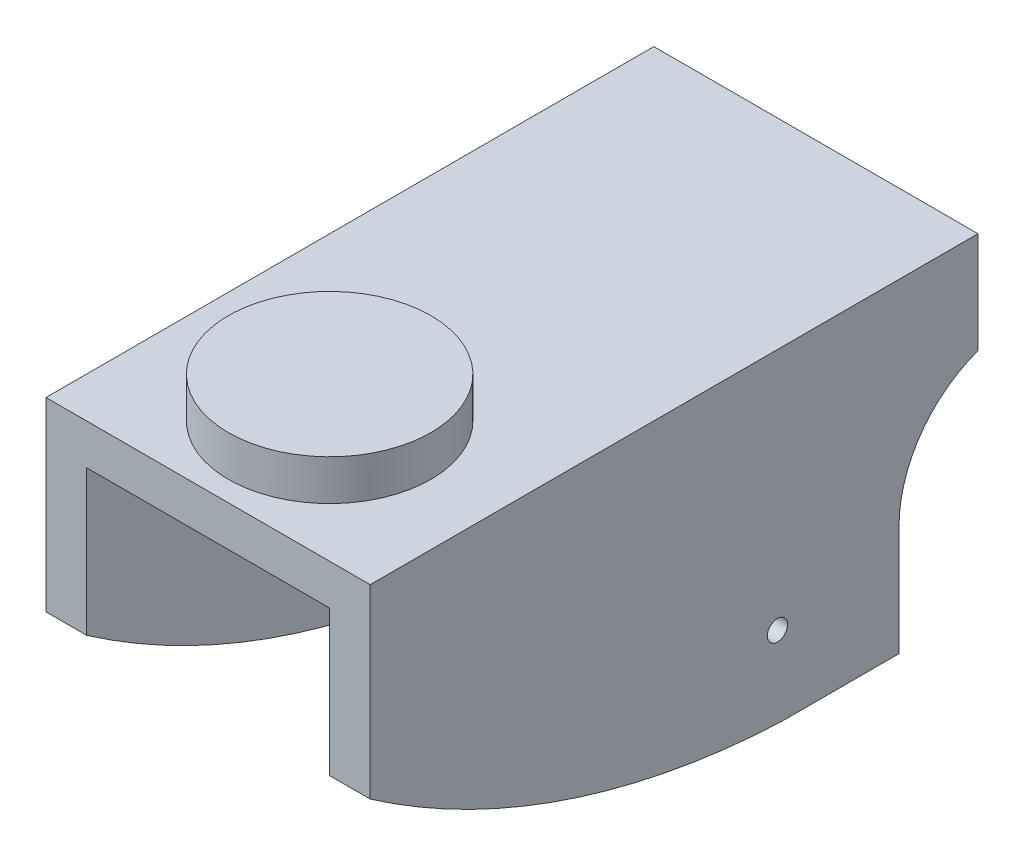
ISO-10303-21;
HEADER;
FILE_DESCRIPTION(('STEP AP214'),'2;1');
FILE_NAME('part.step','',(''),(''),'','','');
FILE_SCHEMA(('AUTOMOTIVE_DESIGN { 1 0 10303 214 1 1 1 1 }'));
ENDSEC;
DATA;
#1=APPLICATION_CONTEXT('core data for automotive mechanical design processes');
#2=APPLICATION_PROTOCOL_DEFINITION('international standard','automotive_design',2000,#1);
#3=PRODUCT_CONTEXT('',#1,'mechanical');
#4=PRODUCT('Part','Part','',(#3));
#5=PRODUCT_RELATED_PRODUCT_CATEGORY('part','',(#4));
#6=PRODUCT_DEFINITION_FORMATION('','',#4);
#7=PRODUCT_DEFINITION_CONTEXT('part definition',#1,'design');
#8=PRODUCT_DEFINITION('design','',#6,#7);
#9=PRODUCT_DEFINITION_SHAPE('','',#8);
#10=(LENGTH_UNIT() NAMED_UNIT(*) SI_UNIT(.MILLI.,.METRE.));
#11=(NAMED_UNIT(*) PLANE_ANGLE_UNIT() SI_UNIT($,.RADIAN.));
#12=(NAMED_UNIT(*) SI_UNIT($,.STERADIAN.) SOLID_ANGLE_UNIT());
#13=UNCERTAINTY_MEASURE_WITH_UNIT(LENGTH_MEASURE(1.E-05),#10,'distance_accuracy_value','');
#14=(GEOMETRIC_REPRESENTATION_CONTEXT(3) GLOBAL_UNCERTAINTY_ASSIGNED_CONTEXT((#13)) GLOBAL_UNIT_ASSIGNED_CONTEXT((#10,
#11,#12)) REPRESENTATION_CONTEXT('',''));
#15=CARTESIAN_POINT('',(0.,0.,0.));
#16=DIRECTION('',(0.,0.,1.));
#17=DIRECTION('',(1.,0.,0.));
#18=AXIS2_PLACEMENT_3D('',#15,#16,#17);
#19=CARTESIAN_POINT('',(20.32,-11.6377323420075,0.));
#20=DIRECTION('',(0.,0.,-1.));
#21=DIRECTION('',(0.,1.,0.));
#22=AXIS2_PLACEMENT_3D('',#19,#20,#21);
#23=PLANE('',#22);
#24=DIRECTION('',(0.,-1.,0.));
#25=VECTOR('',#24,1.);
#26=CARTESIAN_POINT('',(2.54,-11.6377323420075,0.));
#27=LINE('',#26,#25);
#28=CARTESIAN_POINT('',(2.54,-2.54,0.));
#29=VERTEX_POINT('',#28);
#30=CARTESIAN_POINT('',(2.54,-11.6377323420075,0.));
#31=VERTEX_POINT('',#30);
#32=EDGE_CURVE('E251',#29,#31,#27,.T.);
#33=ORIENTED_EDGE('',*,*,#32,.F.);
#34=DIRECTION('',(-1.,0.,0.));
#35=VECTOR('',#34,1.);
#36=CARTESIAN_POINT('',(20.32,-2.54,0.));
#37=LINE('',#36,#35);
#38=CARTESIAN_POINT('',(17.78,-2.54,0.));
#39=VERTEX_POINT('',#38);
#40=EDGE_CURVE('E256',#39,#29,#37,.T.);
#41=ORIENTED_EDGE('',*,*,#40,.F.);
#42=DIRECTION('',(0.,-1.,0.));
#43=VECTOR('',#42,1.);
#44=CARTESIAN_POINT('',(17.78,-11.6377323420075,0.));
#45=LINE('',#44,#43);
#46=CARTESIAN_POINT('',(17.78,-11.6377323420075,0.));
#47=VERTEX_POINT('',#46);
#48=EDGE_CURVE('E253',#39,#47,#45,.T.);
#49=ORIENTED_EDGE('',*,*,#48,.T.);
#50=DIRECTION('',(-1.,0.,0.));
#51=VECTOR('',#50,1.);
#52=CARTESIAN_POINT('',(20.32,-11.6377323420075,0.));
#53=LINE('',#52,#51);
#54=CARTESIAN_POINT('',(20.32,-11.6377323420075,0.));
#55=VERTEX_POINT('',#54);
#56=EDGE_CURVE('E43',#55,#47,#53,.T.);
#57=ORIENTED_EDGE('',*,*,#56,.F.);
#58=DIRECTION('',(0.,-1.,0.));
#59=VECTOR('',#58,1.);
#60=CARTESIAN_POINT('',(20.32,-11.6377323420075,0.));
#61=LINE('',#60,#59);
#62=CARTESIAN_POINT('',(20.32,0.,0.));
#63=VERTEX_POINT('',#62);
#64=EDGE_CURVE('E161',#63,#55,#61,.T.);
#65=ORIENTED_EDGE('',*,*,#64,.F.);
#66=DIRECTION('',(-1.,0.,0.));
#67=VECTOR('',#66,1.);
#68=CARTESIAN_POINT('',(20.32,0.,0.));
#69=LINE('',#68,#67);
#70=CARTESIAN_POINT('',(0.,0.,0.));
#71=VERTEX_POINT('',#70);
#72=EDGE_CURVE('E138',#63,#71,#69,.T.);
#73=ORIENTED_EDGE('',*,*,#72,.T.);
#74=DIRECTION('',(0.,-1.,0.));
#75=VECTOR('',#74,1.);
#76=CARTESIAN_POINT('',(0.,-11.6377323420075,0.));
#77=LINE('',#76,#75);
#78=CARTESIAN_POINT('',(0.,-11.6377323420075,0.));
#79=VERTEX_POINT('',#78);
#80=EDGE_CURVE('E142',#71,#79,#77,.T.);
#81=ORIENTED_EDGE('',*,*,#80,.T.);
#82=EDGE_CURVE('E174',#31,#79,#53,.T.);
#83=ORIENTED_EDGE('',*,*,#82,.F.);
#84=EDGE_LOOP('',(#33,#41,#49,#57,#65,#73,#81,#83));
#85=FACE_BOUND('',#84,.T.);
#86=ADVANCED_FACE('F35',(#85),#23,.F.);
#87=CARTESIAN_POINT('',(20.32,28.3885018094039,-27.8343355726491));
#88=DIRECTION('',(-1.,0.,0.));
#89=DIRECTION('',(0.,0.,1.));
#90=AXIS2_PLACEMENT_3D('',#87,#88,#89);
#91=CYLINDRICAL_SURFACE('',#90,48.752945112213);
#92=CARTESIAN_POINT('',(2.54,28.3885018094039,-27.8343355726491));
#93=DIRECTION('',(1.,0.,0.));
#94=DIRECTION('',(0.,0.,-1.));
#95=AXIS2_PLACEMENT_3D('',#92,#93,#94);
#96=CIRCLE('',#95,48.752945112213);
#97=CARTESIAN_POINT('',(2.54,-20.32,-25.7531079066443));
#98=VERTEX_POINT('',#97);
#99=EDGE_CURVE('E187',#31,#98,#96,.T.);
#100=ORIENTED_EDGE('',*,*,#99,.F.);
#101=ORIENTED_EDGE('',*,*,#82,.T.);
#102=CARTESIAN_POINT('',(0.,28.3885018094039,-27.8343355726491));
#103=DIRECTION('',(1.,0.,0.));
#104=DIRECTION('',(0.,0.,-1.));
#105=AXIS2_PLACEMENT_3D('',#102,#103,#104);
#106=CIRCLE('',#105,48.752945112213);
#107=CARTESIAN_POINT('',(0.,-20.32,-25.7531079066443));
#108=VERTEX_POINT('',#107);
#109=EDGE_CURVE('E145',#79,#108,#106,.T.);
#110=ORIENTED_EDGE('',*,*,#109,.T.);
#111=DIRECTION('',(-1.,0.,0.));
#112=VECTOR('',#111,1.);
#113=CARTESIAN_POINT('',(20.32,-20.32,-25.7531079066443));
#114=LINE('',#113,#112);
#115=EDGE_CURVE('E170',#98,#108,#114,.T.);
#116=ORIENTED_EDGE('',*,*,#115,.F.);
#117=EDGE_LOOP('',(#100,#101,#110,#116));
#118=FACE_BOUND('',#117,.T.);
#119=ADVANCED_FACE('F182',(#118),#91,.T.);
#120=CARTESIAN_POINT('',(20.32,-20.32,-33.1496733662362));
#121=DIRECTION('',(0.,1.,0.));
#122=DIRECTION('',(0.,0.,1.));
#123=AXIS2_PLACEMENT_3D('',#120,#121,#122);
#124=PLANE('',#123);
#125=DIRECTION('',(0.,0.,-1.));
#126=VECTOR('',#125,1.);
#127=CARTESIAN_POINT('',(2.54,-20.32,-33.1496733662362));
#128=LINE('',#127,#126);
#129=CARTESIAN_POINT('',(2.54,-20.32,-33.1496733662362));
#130=VERTEX_POINT('',#129);
#131=EDGE_CURVE('E222',#98,#130,#128,.T.);
#132=ORIENTED_EDGE('',*,*,#131,.F.);
#133=ORIENTED_EDGE('',*,*,#115,.T.);
#134=DIRECTION('',(0.,0.,-1.));
#135=VECTOR('',#134,1.);
#136=CARTESIAN_POINT('',(0.,-20.32,-33.1496733662362));
#137=LINE('',#136,#135);
#138=CARTESIAN_POINT('',(0.,-20.32,-33.1496733662362));
#139=VERTEX_POINT('',#138);
#140=EDGE_CURVE('E149',#108,#139,#137,.T.);
#141=ORIENTED_EDGE('',*,*,#140,.T.);
#142=DIRECTION('',(-1.,0.,0.));
#143=VECTOR('',#142,1.);
#144=CARTESIAN_POINT('',(20.32,-20.32,-33.1496733662362));
#145=LINE('',#144,#143);
#146=EDGE_CURVE('E166',#130,#139,#145,.T.);
#147=ORIENTED_EDGE('',*,*,#146,.F.);
#148=EDGE_LOOP('',(#132,#133,#141,#147));
#149=FACE_BOUND('',#148,.T.);
#150=ADVANCED_FACE('F219',(#149),#124,.F.);
#151=CARTESIAN_POINT('',(20.32,-20.32,-33.1496733662362));
#152=DIRECTION('',(0.,0.,1.));
#153=DIRECTION('',(1.,0.,0.));
#154=AXIS2_PLACEMENT_3D('',#151,#152,#153);
#155=PLANE('',#154);
#156=DIRECTION('',(0.,1.,0.));
#157=VECTOR('',#156,1.);
#158=CARTESIAN_POINT('',(2.54,-20.32,-33.1496733662362));
#159=LINE('',#158,#157);
#160=CARTESIAN_POINT('',(2.54,-13.4044293273129,-33.1496733662362));
#161=VERTEX_POINT('',#160);
#162=EDGE_CURVE('E216',#130,#161,#159,.T.);
#163=ORIENTED_EDGE('',*,*,#162,.F.);
#164=ORIENTED_EDGE('',*,*,#146,.T.);
#165=DIRECTION('',(0.,1.,0.));
#166=VECTOR('',#165,1.);
#167=CARTESIAN_POINT('',(0.,-20.32,-33.1496733662362));
#168=LINE('',#167,#166);
#169=CARTESIAN_POINT('',(0.,-13.4044293273129,-33.1496733662362));
#170=VERTEX_POINT('',#169);
#171=EDGE_CURVE('E152',#139,#170,#168,.T.);
#172=ORIENTED_EDGE('',*,*,#171,.T.);
#173=DIRECTION('',(-1.,0.,0.));
#174=VECTOR('',#173,1.);
#175=CARTESIAN_POINT('',(20.32,-13.4044293273129,-33.1496733662362));
#176=LINE('',#175,#174);
#177=EDGE_CURVE('E131',#161,#170,#176,.T.);
#178=ORIENTED_EDGE('',*,*,#177,.F.);
#179=EDGE_LOOP('',(#163,#164,#172,#178));
#180=FACE_BOUND('',#179,.T.);
#181=ADVANCED_FACE('F212',(#180),#155,.F.);
#182=CARTESIAN_POINT('',(20.32,-13.3838743433241,-40.621978228573));
#183=DIRECTION('',(-1.,0.,0.));
#184=DIRECTION('',(0.,0.,1.));
#185=AXIS2_PLACEMENT_3D('',#182,#183,#184);
#186=CYLINDRICAL_SURFACE('',#185,7.47233313383908);
#187=CARTESIAN_POINT('',(2.54,-13.3838743433241,-40.621978228573));
#188=DIRECTION('',(1.,0.,0.));
#189=DIRECTION('',(0.,0.,-1.));
#190=AXIS2_PLACEMENT_3D('',#187,#188,#189);
#191=CIRCLE('',#190,7.47233313383908);
#192=CARTESIAN_POINT('',(2.54,-6.35,-38.1));
#193=VERTEX_POINT('',#192);
#194=EDGE_CURVE('E209',#161,#193,#191,.F.);
#195=ORIENTED_EDGE('',*,*,#194,.F.);
#196=ORIENTED_EDGE('',*,*,#177,.T.);
#197=CARTESIAN_POINT('',(0.,-13.3838743433241,-40.621978228573));
#198=DIRECTION('',(-1.,0.,0.));
#199=DIRECTION('',(0.,0.,-1.));
#200=AXIS2_PLACEMENT_3D('',#197,#198,#199);
#201=CIRCLE('',#200,7.47233313383908);
#202=CARTESIAN_POINT('',(0.,-6.35,-38.1));
#203=VERTEX_POINT('',#202);
#204=EDGE_CURVE('E155',#170,#203,#201,.T.);
#205=ORIENTED_EDGE('',*,*,#204,.T.);
#206=DIRECTION('',(-1.,0.,0.));
#207=VECTOR('',#206,1.);
#208=CARTESIAN_POINT('',(20.32,-6.35,-38.1));
#209=LINE('',#208,#207);
#210=EDGE_CURVE('E132',#193,#203,#209,.T.);
#211=ORIENTED_EDGE('',*,*,#210,.F.);
#212=EDGE_LOOP('',(#195,#196,#205,#211));
#213=FACE_BOUND('',#212,.T.);
#214=ADVANCED_FACE('F205',(#213),#186,.F.);
#215=CARTESIAN_POINT('',(20.32,0.,-38.1));
#216=DIRECTION('',(0.,0.,1.));
#217=DIRECTION('',(1.,0.,0.));
#218=AXIS2_PLACEMENT_3D('',#215,#216,#217);
#219=PLANE('',#218);
#220=DIRECTION('',(0.,1.,0.));
#221=VECTOR('',#220,1.);
#222=CARTESIAN_POINT('',(2.54,0.,-38.1));
#223=LINE('',#222,#221);
#224=CARTESIAN_POINT('',(2.54,-2.54,-38.1));
#225=VERTEX_POINT('',#224);
#226=EDGE_CURVE('E202',#193,#225,#223,.T.);
#227=ORIENTED_EDGE('',*,*,#226,.F.);
#228=ORIENTED_EDGE('',*,*,#210,.T.);
#229=DIRECTION('',(0.,1.,0.));
#230=VECTOR('',#229,1.);
#231=CARTESIAN_POINT('',(0.,0.,-38.1));
#232=LINE('',#231,#230);
#233=CARTESIAN_POINT('',(0.,0.,-38.1));
#234=VERTEX_POINT('',#233);
#235=EDGE_CURVE('E158',#203,#234,#232,.T.);
#236=ORIENTED_EDGE('',*,*,#235,.T.);
#237=DIRECTION('',(-1.,0.,0.));
#238=VECTOR('',#237,1.);
#239=CARTESIAN_POINT('',(20.32,0.,-38.1));
#240=LINE('',#239,#238);
#241=CARTESIAN_POINT('',(20.32,0.,-38.1));
#242=VERTEX_POINT('',#241);
#243=EDGE_CURVE('E136',#242,#234,#240,.T.);
#244=ORIENTED_EDGE('',*,*,#243,.F.);
#245=DIRECTION('',(0.,1.,0.));
#246=VECTOR('',#245,1.);
#247=CARTESIAN_POINT('',(20.32,0.,-38.1));
#248=LINE('',#247,#246);
#249=CARTESIAN_POINT('',(20.32,-6.35,-38.1));
#250=VERTEX_POINT('',#249);
#251=EDGE_CURVE('E114',#250,#242,#248,.T.);
#252=ORIENTED_EDGE('',*,*,#251,.F.);
#253=CARTESIAN_POINT('',(17.78,-6.35,-38.1));
#254=VERTEX_POINT('',#253);
#255=EDGE_CURVE('E124',#250,#254,#209,.T.);
#256=ORIENTED_EDGE('',*,*,#255,.T.);
#257=DIRECTION('',(0.,1.,0.));
#258=VECTOR('',#257,1.);
#259=CARTESIAN_POINT('',(17.78,0.,-38.1));
#260=LINE('',#259,#258);
#261=CARTESIAN_POINT('',(17.78,-2.54,-38.1));
#262=VERTEX_POINT('',#261);
#263=EDGE_CURVE('E272',#254,#262,#260,.T.);
#264=ORIENTED_EDGE('',*,*,#263,.T.);
#265=DIRECTION('',(-1.,0.,0.));
#266=VECTOR('',#265,1.);
#267=CARTESIAN_POINT('',(20.32,-2.54,-38.1));
#268=LINE('',#267,#266);
#269=EDGE_CURVE('E146',#262,#225,#268,.T.);
#270=ORIENTED_EDGE('',*,*,#269,.T.);
#271=EDGE_LOOP('',(#227,#228,#236,#244,#252,#256,#264,#270));
#272=FACE_BOUND('',#271,.T.);
#273=ADVANCED_FACE('F135',(#272),#219,.F.);
#274=ORIENTED_EDGE('',*,*,#56,.T.);
#275=CARTESIAN_POINT('',(17.78,28.3885018094039,-27.8343355726491));
#276=DIRECTION('',(1.,0.,0.));
#277=DIRECTION('',(0.,0.,-1.));
#278=AXIS2_PLACEMENT_3D('',#275,#276,#277);
#279=CIRCLE('',#278,48.752945112213);
#280=CARTESIAN_POINT('',(17.78,-20.32,-25.7531079066443));
#281=VERTEX_POINT('',#280);
#282=EDGE_CURVE('E244',#47,#281,#279,.T.);
#283=ORIENTED_EDGE('',*,*,#282,.T.);
#284=CARTESIAN_POINT('',(20.32,-20.32,-25.7531079066443));
#285=VERTEX_POINT('',#284);
#286=EDGE_CURVE('E171',#285,#281,#114,.T.);
#287=ORIENTED_EDGE('',*,*,#286,.F.);
#288=CARTESIAN_POINT('',(20.32,28.3885018094039,-27.8343355726491));
#289=DIRECTION('',(1.,0.,0.));
#290=DIRECTION('',(0.,0.,-1.));
#291=AXIS2_PLACEMENT_3D('',#288,#289,#290);
#292=CIRCLE('',#291,48.752945112213);
#293=EDGE_CURVE('E98',#55,#285,#292,.T.);
#294=ORIENTED_EDGE('',*,*,#293,.F.);
#295=EDGE_LOOP('',(#274,#283,#287,#294));
#296=FACE_BOUND('',#295,.T.);
#297=ADVANCED_FACE('F293',(#296),#91,.T.);
#298=ORIENTED_EDGE('',*,*,#286,.T.);
#299=DIRECTION('',(0.,0.,-1.));
#300=VECTOR('',#299,1.);
#301=CARTESIAN_POINT('',(17.78,-20.32,-33.1496733662362));
#302=LINE('',#301,#300);
#303=CARTESIAN_POINT('',(17.78,-20.32,-33.1496733662362));
#304=VERTEX_POINT('',#303);
#305=EDGE_CURVE('E278',#281,#304,#302,.T.);
#306=ORIENTED_EDGE('',*,*,#305,.T.);
#307=CARTESIAN_POINT('',(20.32,-20.32,-33.1496733662362));
#308=VERTEX_POINT('',#307);
#309=EDGE_CURVE('E167',#308,#304,#145,.T.);
#310=ORIENTED_EDGE('',*,*,#309,.F.);
#311=DIRECTION('',(0.,0.,-1.));
#312=VECTOR('',#311,1.);
#313=CARTESIAN_POINT('',(20.32,-20.32,-33.1496733662362));
#314=LINE('',#313,#312);
#315=EDGE_CURVE('E285',#285,#308,#314,.T.);
#316=ORIENTED_EDGE('',*,*,#315,.F.);
#317=EDGE_LOOP('',(#298,#306,#310,#316));
#318=FACE_BOUND('',#317,.T.);
#319=ADVANCED_FACE('F289',(#318),#124,.F.);
#320=ORIENTED_EDGE('',*,*,#309,.T.);
#321=DIRECTION('',(0.,1.,0.));
#322=VECTOR('',#321,1.);
#323=CARTESIAN_POINT('',(17.78,-20.32,-33.1496733662362));
#324=LINE('',#323,#322);
#325=CARTESIAN_POINT('',(17.78,-13.4044293273129,-33.1496733662362));
#326=VERTEX_POINT('',#325);
#327=EDGE_CURVE('E275',#304,#326,#324,.T.);
#328=ORIENTED_EDGE('',*,*,#327,.T.);
#329=CARTESIAN_POINT('',(20.32,-13.4044293273129,-33.1496733662362));
#330=VERTEX_POINT('',#329);
#331=EDGE_CURVE('E164',#330,#326,#176,.T.);
#332=ORIENTED_EDGE('',*,*,#331,.F.);
#333=DIRECTION('',(0.,1.,0.));
#334=VECTOR('',#333,1.);
#335=CARTESIAN_POINT('',(20.32,-20.32,-33.1496733662362));
#336=LINE('',#335,#334);
#337=EDGE_CURVE('E117',#308,#330,#336,.T.);
#338=ORIENTED_EDGE('',*,*,#337,.F.);
#339=EDGE_LOOP('',(#320,#328,#332,#338));
#340=FACE_BOUND('',#339,.T.);
#341=ADVANCED_FACE('F291',(#340),#155,.F.);
#342=ORIENTED_EDGE('',*,*,#331,.T.);
#343=CARTESIAN_POINT('',(17.78,-13.3838743433241,-40.621978228573));
#344=DIRECTION('',(1.,0.,0.));
#345=DIRECTION('',(0.,0.,-1.));
#346=AXIS2_PLACEMENT_3D('',#343,#344,#345);
#347=CIRCLE('',#346,7.47233313383908);
#348=EDGE_CURVE('E128',#326,#254,#347,.F.);
#349=ORIENTED_EDGE('',*,*,#348,.T.);
#350=ORIENTED_EDGE('',*,*,#255,.F.);
#351=CARTESIAN_POINT('',(20.32,-13.3838743433241,-40.621978228573));
#352=DIRECTION('',(-1.,0.,0.));
#353=DIRECTION('',(0.,0.,-1.));
#354=AXIS2_PLACEMENT_3D('',#351,#352,#353);
#355=CIRCLE('',#354,7.47233313383908);
#356=EDGE_CURVE('E110',#330,#250,#355,.T.);
#357=ORIENTED_EDGE('',*,*,#356,.F.);
#358=EDGE_LOOP('',(#342,#349,#350,#357));
#359=FACE_BOUND('',#358,.T.);
#360=ADVANCED_FACE('F125',(#359),#186,.F.);
#361=CARTESIAN_POINT('',(20.32,0.,0.));
#362=DIRECTION('',(0.,-1.,0.));
#363=DIRECTION('',(0.,0.,-1.));
#364=AXIS2_PLACEMENT_3D('',#361,#362,#363);
#365=PLANE('',#364);
#366=CARTESIAN_POINT('',(10.16,0.,-7.62));
#367=DIRECTION('',(0.,-1.,0.));
#368=DIRECTION('',(0.,0.,-1.));
#369=AXIS2_PLACEMENT_3D('',#366,#367,#368);
#370=CIRCLE('',#369,6.35);
#371=CARTESIAN_POINT('',(10.16,0.,-13.97));
#372=VERTEX_POINT('',#371);
#373=EDGE_CURVE('E11',#372,#372,#370,.F.);
#374=ORIENTED_EDGE('',*,*,#373,.F.);
#375=EDGE_LOOP('',(#374));
#376=FACE_BOUND('',#375,.T.);
#377=DIRECTION('',(0.,0.,1.));
#378=VECTOR('',#377,1.);
#379=CARTESIAN_POINT('',(0.,0.,0.));
#380=LINE('',#379,#378);
#381=EDGE_CURVE('E89',#234,#71,#380,.T.);
#382=ORIENTED_EDGE('',*,*,#381,.T.);
#383=ORIENTED_EDGE('',*,*,#72,.F.);
#384=DIRECTION('',(0.,0.,1.));
#385=VECTOR('',#384,1.);
#386=CARTESIAN_POINT('',(20.32,0.,0.));
#387=LINE('',#386,#385);
#388=EDGE_CURVE('E59',#242,#63,#387,.T.);
#389=ORIENTED_EDGE('',*,*,#388,.F.);
#390=ORIENTED_EDGE('',*,*,#243,.T.);
#391=EDGE_LOOP('',(#382,#383,#389,#390));
#392=FACE_BOUND('',#391,.T.);
#393=ADVANCED_FACE('F195',(#376,#392),#365,.F.);
#394=CARTESIAN_POINT('',(20.32,-13.3838743433241,-40.621978228573));
#395=DIRECTION('',(1.,0.,0.));
#396=DIRECTION('',(0.,0.,-1.));
#397=AXIS2_PLACEMENT_3D('',#394,#395,#396);
#398=PLANE('',#397);
#399=CARTESIAN_POINT('',(20.32,-15.24,-25.5296733662362));
#400=DIRECTION('',(1.,0.,0.));
#401=DIRECTION('',(0.,0.,-1.));
#402=AXIS2_PLACEMENT_3D('',#399,#400,#401);
#403=CIRCLE('',#402,0.634999999999995);
#404=CARTESIAN_POINT('',(20.32,-15.24,-26.1646733662362));
#405=VERTEX_POINT('',#404);
#406=EDGE_CURVE('E263',#405,#405,#403,.T.);
#407=ORIENTED_EDGE('',*,*,#406,.F.);
#408=EDGE_LOOP('',(#407));
#409=FACE_BOUND('',#408,.T.);
#410=ORIENTED_EDGE('',*,*,#64,.T.);
#411=ORIENTED_EDGE('',*,*,#293,.T.);
#412=ORIENTED_EDGE('',*,*,#315,.T.);
#413=ORIENTED_EDGE('',*,*,#337,.T.);
#414=ORIENTED_EDGE('',*,*,#356,.T.);
#415=ORIENTED_EDGE('',*,*,#251,.T.);
#416=ORIENTED_EDGE('',*,*,#388,.T.);
#417=EDGE_LOOP('',(#410,#411,#412,#413,#414,#415,#416));
#418=FACE_BOUND('',#417,.T.);
#419=ADVANCED_FACE('F112',(#409,#418),#398,.T.);
#420=CARTESIAN_POINT('',(0.,-13.3838743433241,-40.621978228573));
#421=DIRECTION('',(1.,0.,0.));
#422=DIRECTION('',(0.,0.,-1.));
#423=AXIS2_PLACEMENT_3D('',#420,#421,#422);
#424=PLANE('',#423);
#425=CARTESIAN_POINT('',(0.,-15.24,-25.5296733662362));
#426=DIRECTION('',(1.,0.,0.));
#427=DIRECTION('',(0.,0.,-1.));
#428=AXIS2_PLACEMENT_3D('',#425,#426,#427);
#429=CIRCLE('',#428,0.634999999999995);
#430=CARTESIAN_POINT('',(0.,-15.24,-26.1646733662362));
#431=VERTEX_POINT('',#430);
#432=EDGE_CURVE('E464',#431,#431,#429,.T.);
#433=ORIENTED_EDGE('',*,*,#432,.T.);
#434=EDGE_LOOP('',(#433));
#435=FACE_BOUND('',#434,.T.);
#436=ORIENTED_EDGE('',*,*,#80,.F.);
#437=ORIENTED_EDGE('',*,*,#381,.F.);
#438=ORIENTED_EDGE('',*,*,#235,.F.);
#439=ORIENTED_EDGE('',*,*,#204,.F.);
#440=ORIENTED_EDGE('',*,*,#171,.F.);
#441=ORIENTED_EDGE('',*,*,#140,.F.);
#442=ORIENTED_EDGE('',*,*,#109,.F.);
#443=EDGE_LOOP('',(#436,#437,#438,#439,#440,#441,#442));
#444=FACE_BOUND('',#443,.T.);
#445=ADVANCED_FACE('F192',(#435,#444),#424,.F.);
#446=CARTESIAN_POINT('',(20.32,-2.54,0.));
#447=DIRECTION('',(0.,-1.,0.));
#448=DIRECTION('',(0.,0.,-1.));
#449=AXIS2_PLACEMENT_3D('',#446,#447,#448);
#450=PLANE('',#449);
#451=DIRECTION('',(0.,0.,1.));
#452=VECTOR('',#451,1.);
#453=CARTESIAN_POINT('',(2.54,-2.54,0.));
#454=LINE('',#453,#452);
#455=EDGE_CURVE('E248',#225,#29,#454,.T.);
#456=ORIENTED_EDGE('',*,*,#455,.F.);
#457=ORIENTED_EDGE('',*,*,#269,.F.);
#458=DIRECTION('',(0.,0.,1.));
#459=VECTOR('',#458,1.);
#460=CARTESIAN_POINT('',(17.78,-2.54,0.));
#461=LINE('',#460,#459);
#462=EDGE_CURVE('E50',#262,#39,#461,.T.);
#463=ORIENTED_EDGE('',*,*,#462,.T.);
#464=ORIENTED_EDGE('',*,*,#40,.T.);
#465=EDGE_LOOP('',(#456,#457,#463,#464));
#466=FACE_BOUND('',#465,.T.);
#467=ADVANCED_FACE('F257',(#466),#450,.T.);
#468=CARTESIAN_POINT('',(17.78,-13.3838743433241,-40.621978228573));
#469=DIRECTION('',(1.,0.,0.));
#470=DIRECTION('',(0.,0.,-1.));
#471=AXIS2_PLACEMENT_3D('',#468,#469,#470);
#472=PLANE('',#471);
#473=CARTESIAN_POINT('',(17.78,-15.24,-25.5296733662362));
#474=DIRECTION('',(1.,0.,0.));
#475=DIRECTION('',(0.,0.,-1.));
#476=AXIS2_PLACEMENT_3D('',#473,#474,#475);
#477=CIRCLE('',#476,0.634999999999995);
#478=CARTESIAN_POINT('',(17.78,-15.24,-26.1646733662362));
#479=VERTEX_POINT('',#478);
#480=EDGE_CURVE('E460',#479,#479,#477,.T.);
#481=ORIENTED_EDGE('',*,*,#480,.T.);
#482=EDGE_LOOP('',(#481));
#483=FACE_BOUND('',#482,.T.);
#484=ORIENTED_EDGE('',*,*,#48,.F.);
#485=ORIENTED_EDGE('',*,*,#462,.F.);
#486=ORIENTED_EDGE('',*,*,#263,.F.);
#487=ORIENTED_EDGE('',*,*,#348,.F.);
#488=ORIENTED_EDGE('',*,*,#327,.F.);
#489=ORIENTED_EDGE('',*,*,#305,.F.);
#490=ORIENTED_EDGE('',*,*,#282,.F.);
#491=EDGE_LOOP('',(#484,#485,#486,#487,#488,#489,#490));
#492=FACE_BOUND('',#491,.T.);
#493=ADVANCED_FACE('F292',(#483,#492),#472,.F.);
#494=CARTESIAN_POINT('',(2.54,-13.3838743433241,-40.621978228573));
#495=DIRECTION('',(1.,0.,0.));
#496=DIRECTION('',(0.,0.,-1.));
#497=AXIS2_PLACEMENT_3D('',#494,#495,#496);
#498=PLANE('',#497);
#499=CARTESIAN_POINT('',(2.54,-15.24,-25.5296733662362));
#500=DIRECTION('',(1.,0.,0.));
#501=DIRECTION('',(0.,0.,-1.));
#502=AXIS2_PLACEMENT_3D('',#499,#500,#501);
#503=CIRCLE('',#502,0.634999999999995);
#504=CARTESIAN_POINT('',(2.54,-15.24,-26.1646733662362));
#505=VERTEX_POINT('',#504);
#506=EDGE_CURVE('E38',#505,#505,#503,.T.);
#507=ORIENTED_EDGE('',*,*,#506,.F.);
#508=EDGE_LOOP('',(#507));
#509=FACE_BOUND('',#508,.T.);
#510=ORIENTED_EDGE('',*,*,#32,.T.);
#511=ORIENTED_EDGE('',*,*,#99,.T.);
#512=ORIENTED_EDGE('',*,*,#131,.T.);
#513=ORIENTED_EDGE('',*,*,#162,.T.);
#514=ORIENTED_EDGE('',*,*,#194,.T.);
#515=ORIENTED_EDGE('',*,*,#226,.T.);
#516=ORIENTED_EDGE('',*,*,#455,.T.);
#517=EDGE_LOOP('',(#510,#511,#512,#513,#514,#515,#516));
#518=FACE_BOUND('',#517,.T.);
#519=ADVANCED_FACE('F250',(#509,#518),#498,.T.);
#520=CARTESIAN_POINT('',(10.16,2.54,-7.62));
#521=DIRECTION('',(0.,-1.,0.));
#522=DIRECTION('',(0.,0.,-1.));
#523=AXIS2_PLACEMENT_3D('',#520,#521,#522);
#524=CYLINDRICAL_SURFACE('',#523,6.35);
#525=CARTESIAN_POINT('',(10.16,2.54,-7.62));
#526=DIRECTION('',(0.,1.,0.));
#527=DIRECTION('',(0.,0.,1.));
#528=AXIS2_PLACEMENT_3D('',#525,#526,#527);
#529=CIRCLE('',#528,6.35);
#530=CARTESIAN_POINT('',(10.16,2.54,-1.26999999999999));
#531=VERTEX_POINT('',#530);
#532=EDGE_CURVE('E259',#531,#531,#529,.T.);
#533=ORIENTED_EDGE('',*,*,#532,.F.);
#534=EDGE_LOOP('',(#533));
#535=FACE_BOUND('',#534,.T.);
#536=ORIENTED_EDGE('',*,*,#373,.T.);
#537=EDGE_LOOP('',(#536));
#538=FACE_BOUND('',#537,.T.);
#539=ADVANCED_FACE('F387',(#535,#538),#524,.T.);
#540=CARTESIAN_POINT('',(10.16,2.54,-7.62));
#541=DIRECTION('',(0.,1.,0.));
#542=DIRECTION('',(0.,0.,1.));
#543=AXIS2_PLACEMENT_3D('',#540,#541,#542);
#544=PLANE('',#543);
#545=ORIENTED_EDGE('',*,*,#532,.T.);
#546=EDGE_LOOP('',(#545));
#547=FACE_BOUND('',#546,.T.);
#548=ADVANCED_FACE('F392',(#547),#544,.T.);
#549=CARTESIAN_POINT('',(0.,-15.24,-25.5296733662362));
#550=DIRECTION('',(1.,0.,0.));
#551=DIRECTION('',(0.,0.,-1.));
#552=AXIS2_PLACEMENT_3D('',#549,#550,#551);
#553=CYLINDRICAL_SURFACE('',#552,0.634999999999995);
#554=ORIENTED_EDGE('',*,*,#506,.T.);
#555=EDGE_LOOP('',(#554));
#556=FACE_BOUND('',#555,.T.);
#557=ORIENTED_EDGE('',*,*,#432,.F.);
#558=EDGE_LOOP('',(#557));
#559=FACE_BOUND('',#558,.T.);
#560=ADVANCED_FACE('F404',(#556,#559),#553,.F.);
#561=ORIENTED_EDGE('',*,*,#406,.T.);
#562=EDGE_LOOP('',(#561));
#563=FACE_BOUND('',#562,.T.);
#564=ORIENTED_EDGE('',*,*,#480,.F.);
#565=EDGE_LOOP('',(#564));
#566=FACE_BOUND('',#565,.T.);
#567=ADVANCED_FACE('F442',(#563,#566),#553,.F.);
#568=CLOSED_SHELL('',(#86,#119,#150,#181,#214,#273,#297,#319,#341,#360,#393,#419,#445,#467,#493,
#519,#539,#548,#560,#567));
#569=MANIFOLD_SOLID_BREP('B2',#568);
#570=ADVANCED_BREP_SHAPE_REPRESENTATION('',(#18,#569),#14);
#571=SHAPE_DEFINITION_REPRESENTATION(#9,#570);
ENDSEC;
END-ISO-10303-21;
